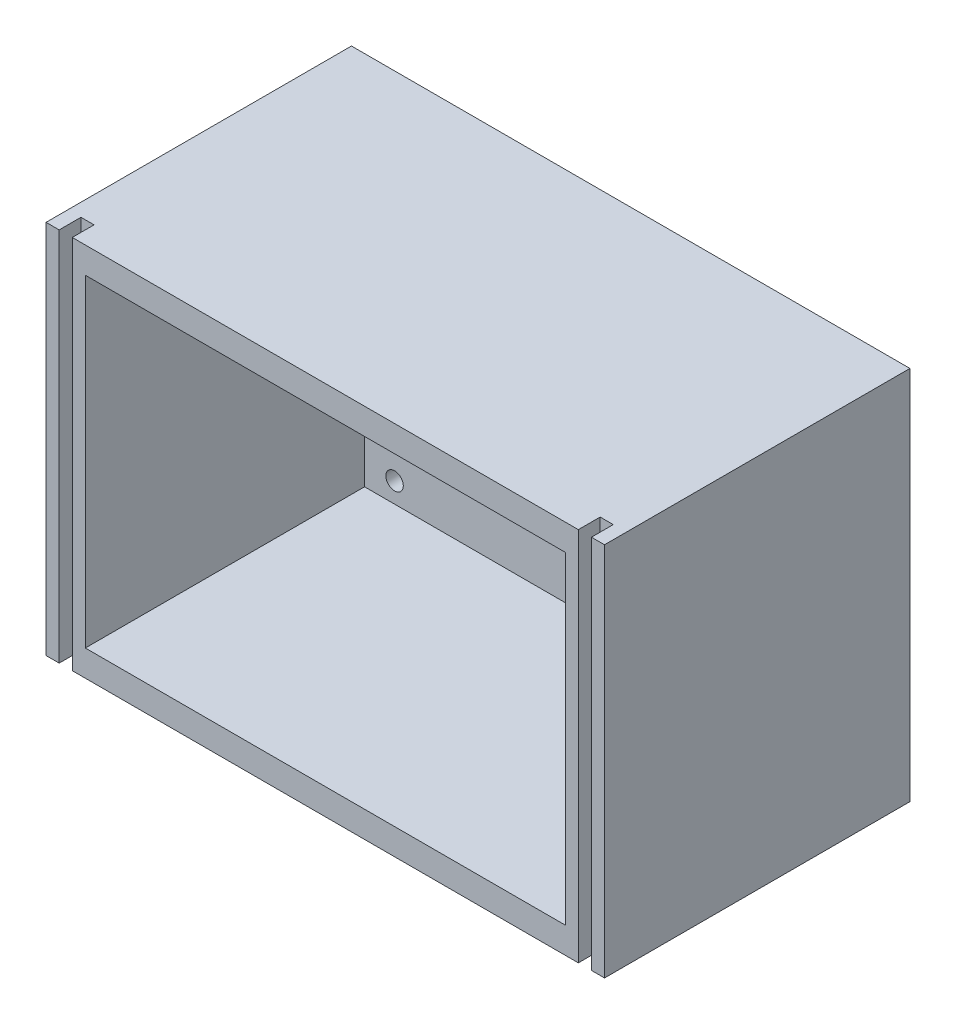
ISO-10303-21;
HEADER;
FILE_DESCRIPTION(('STEP AP214'),'2;1');
FILE_NAME('part.step','',(''),(''),'','','');
FILE_SCHEMA(('AUTOMOTIVE_DESIGN { 1 0 10303 214 1 1 1 1 }'));
ENDSEC;
DATA;
#1=APPLICATION_CONTEXT('core data for automotive mechanical design processes');
#2=APPLICATION_PROTOCOL_DEFINITION('international standard','automotive_design',2000,#1);
#3=PRODUCT_CONTEXT('',#1,'mechanical');
#4=PRODUCT('Part','Part','',(#3));
#5=PRODUCT_RELATED_PRODUCT_CATEGORY('part','',(#4));
#6=PRODUCT_DEFINITION_FORMATION('','',#4);
#7=PRODUCT_DEFINITION_CONTEXT('part definition',#1,'design');
#8=PRODUCT_DEFINITION('design','',#6,#7);
#9=PRODUCT_DEFINITION_SHAPE('','',#8);
#10=(LENGTH_UNIT() NAMED_UNIT(*) SI_UNIT(.MILLI.,.METRE.));
#11=(NAMED_UNIT(*) PLANE_ANGLE_UNIT() SI_UNIT($,.RADIAN.));
#12=(NAMED_UNIT(*) SI_UNIT($,.STERADIAN.) SOLID_ANGLE_UNIT());
#13=UNCERTAINTY_MEASURE_WITH_UNIT(LENGTH_MEASURE(1.E-05),#10,'distance_accuracy_value','');
#14=(GEOMETRIC_REPRESENTATION_CONTEXT(3) GLOBAL_UNCERTAINTY_ASSIGNED_CONTEXT((#13)) GLOBAL_UNIT_ASSIGNED_CONTEXT((#10,
#11,#12)) REPRESENTATION_CONTEXT('',''));
#15=CARTESIAN_POINT('',(0.,0.,0.));
#16=DIRECTION('',(0.,0.,1.));
#17=DIRECTION('',(1.,0.,0.));
#18=AXIS2_PLACEMENT_3D('',#15,#16,#17);
#19=CARTESIAN_POINT('',(60.4226804123711,0.,70.));
#20=DIRECTION('',(-1.,0.,0.));
#21=DIRECTION('',(0.,0.,1.));
#22=AXIS2_PLACEMENT_3D('',#19,#20,#21);
#23=PLANE('',#22);
#24=DIRECTION('',(0.,0.,-1.));
#25=VECTOR('',#24,1.);
#26=CARTESIAN_POINT('',(60.4226804123711,-41.7216494845361,70.));
#27=LINE('',#26,#25);
#28=CARTESIAN_POINT('',(60.4226804123711,-41.7216494845361,70.));
#29=VERTEX_POINT('',#28);
#30=CARTESIAN_POINT('',(60.4226804123711,-41.7216494845361,65.));
#31=VERTEX_POINT('',#30);
#32=EDGE_CURVE('E316',#29,#31,#27,.T.);
#33=ORIENTED_EDGE('',*,*,#32,.T.);
#34=DIRECTION('',(0.,1.,0.));
#35=VECTOR('',#34,1.);
#36=CARTESIAN_POINT('',(60.4226804123711,38.2783505154639,65.));
#37=LINE('',#36,#35);
#38=CARTESIAN_POINT('',(60.4226804123711,44.2783505154639,65.));
#39=VERTEX_POINT('',#38);
#40=EDGE_CURVE('E252',#31,#39,#37,.T.);
#41=ORIENTED_EDGE('',*,*,#40,.T.);
#42=DIRECTION('',(0.,0.,-1.));
#43=VECTOR('',#42,1.);
#44=CARTESIAN_POINT('',(60.4226804123711,44.2783505154639,70.));
#45=LINE('',#44,#43);
#46=CARTESIAN_POINT('',(60.4226804123711,44.2783505154639,70.));
#47=VERTEX_POINT('',#46);
#48=EDGE_CURVE('E11',#47,#39,#45,.T.);
#49=ORIENTED_EDGE('',*,*,#48,.F.);
#50=DIRECTION('',(0.,1.,0.));
#51=VECTOR('',#50,1.);
#52=CARTESIAN_POINT('',(60.4226804123711,0.,70.));
#53=LINE('',#52,#51);
#54=EDGE_CURVE('E305',#29,#47,#53,.T.);
#55=ORIENTED_EDGE('',*,*,#54,.F.);
#56=EDGE_LOOP('',(#33,#41,#49,#55));
#57=FACE_BOUND('',#56,.T.);
#58=ADVANCED_FACE('F35',(#57),#23,.F.);
#59=CARTESIAN_POINT('',(0.,44.2783505154639,70.));
#60=DIRECTION('',(0.,1.,0.));
#61=DIRECTION('',(0.,0.,1.));
#62=AXIS2_PLACEMENT_3D('',#59,#60,#61);
#63=PLANE('',#62);
#64=DIRECTION('',(1.,0.,0.));
#65=VECTOR('',#64,1.);
#66=CARTESIAN_POINT('',(0.,44.2783505154639,0.));
#67=LINE('',#66,#65);
#68=CARTESIAN_POINT('',(-61.5773195876289,44.2783505154639,0.));
#69=VERTEX_POINT('',#68);
#70=CARTESIAN_POINT('',(66.4226804123711,44.2783505154639,0.));
#71=VERTEX_POINT('',#70);
#72=EDGE_CURVE('E295',#69,#71,#67,.T.);
#73=ORIENTED_EDGE('',*,*,#72,.F.);
#74=DIRECTION('',(0.,0.,-1.));
#75=VECTOR('',#74,1.);
#76=CARTESIAN_POINT('',(-61.5773195876289,44.2783505154639,70.));
#77=LINE('',#76,#75);
#78=CARTESIAN_POINT('',(-61.5773195876289,44.2783505154639,70.));
#79=VERTEX_POINT('',#78);
#80=EDGE_CURVE('E278',#79,#69,#77,.T.);
#81=ORIENTED_EDGE('',*,*,#80,.F.);
#82=DIRECTION('',(1.,0.,0.));
#83=VECTOR('',#82,1.);
#84=CARTESIAN_POINT('',(0.,44.2783505154639,70.));
#85=LINE('',#84,#83);
#86=CARTESIAN_POINT('',(-58.5773195876289,44.2783505154639,70.));
#87=VERTEX_POINT('',#86);
#88=EDGE_CURVE('E264',#79,#87,#85,.T.);
#89=ORIENTED_EDGE('',*,*,#88,.T.);
#90=DIRECTION('',(0.,0.,-1.));
#91=VECTOR('',#90,1.);
#92=CARTESIAN_POINT('',(-58.5773195876289,44.2783505154639,70.));
#93=LINE('',#92,#91);
#94=CARTESIAN_POINT('',(-58.5773195876289,44.2783505154639,65.));
#95=VERTEX_POINT('',#94);
#96=EDGE_CURVE('E281',#87,#95,#93,.T.);
#97=ORIENTED_EDGE('',*,*,#96,.T.);
#98=DIRECTION('',(1.,0.,0.));
#99=VECTOR('',#98,1.);
#100=CARTESIAN_POINT('',(-58.5773195876289,44.2783505154639,65.));
#101=LINE('',#100,#99);
#102=CARTESIAN_POINT('',(-55.5773195876289,44.2783505154639,65.));
#103=VERTEX_POINT('',#102);
#104=EDGE_CURVE('E292',#95,#103,#101,.T.);
#105=ORIENTED_EDGE('',*,*,#104,.T.);
#106=DIRECTION('',(0.,0.,-1.));
#107=VECTOR('',#106,1.);
#108=CARTESIAN_POINT('',(-55.5773195876289,44.2783505154639,70.));
#109=LINE('',#108,#107);
#110=CARTESIAN_POINT('',(-55.5773195876289,44.2783505154639,70.));
#111=VERTEX_POINT('',#110);
#112=EDGE_CURVE('E44',#111,#103,#109,.T.);
#113=ORIENTED_EDGE('',*,*,#112,.F.);
#114=DIRECTION('',(1.,0.,0.));
#115=VECTOR('',#114,1.);
#116=CARTESIAN_POINT('',(0.,44.2783505154639,70.));
#117=LINE('',#116,#115);
#118=EDGE_CURVE('E307',#111,#47,#117,.T.);
#119=ORIENTED_EDGE('',*,*,#118,.T.);
#120=ORIENTED_EDGE('',*,*,#48,.T.);
#121=DIRECTION('',(-1.,0.,0.));
#122=VECTOR('',#121,1.);
#123=CARTESIAN_POINT('',(63.4226804123711,44.2783505154639,65.));
#124=LINE('',#123,#122);
#125=CARTESIAN_POINT('',(63.4226804123711,44.2783505154639,65.));
#126=VERTEX_POINT('',#125);
#127=EDGE_CURVE('E255',#126,#39,#124,.T.);
#128=ORIENTED_EDGE('',*,*,#127,.F.);
#129=DIRECTION('',(0.,0.,-1.));
#130=VECTOR('',#129,1.);
#131=CARTESIAN_POINT('',(63.4226804123711,44.2783505154639,70.));
#132=LINE('',#131,#130);
#133=CARTESIAN_POINT('',(63.4226804123711,44.2783505154639,70.));
#134=VERTEX_POINT('',#133);
#135=EDGE_CURVE('E236',#134,#126,#132,.T.);
#136=ORIENTED_EDGE('',*,*,#135,.F.);
#137=DIRECTION('',(1.,0.,0.));
#138=VECTOR('',#137,1.);
#139=CARTESIAN_POINT('',(0.,44.2783505154639,70.));
#140=LINE('',#139,#138);
#141=CARTESIAN_POINT('',(66.4226804123711,44.2783505154639,70.));
#142=VERTEX_POINT('',#141);
#143=EDGE_CURVE('E233',#134,#142,#140,.T.);
#144=ORIENTED_EDGE('',*,*,#143,.T.);
#145=DIRECTION('',(0.,0.,-1.));
#146=VECTOR('',#145,1.);
#147=CARTESIAN_POINT('',(66.4226804123711,44.2783505154639,70.));
#148=LINE('',#147,#146);
#149=EDGE_CURVE('E240',#142,#71,#148,.T.);
#150=ORIENTED_EDGE('',*,*,#149,.T.);
#151=EDGE_LOOP('',(#73,#81,#89,#97,#105,#113,#119,#120,#128,#136,#144,#150));
#152=FACE_BOUND('',#151,.T.);
#153=ADVANCED_FACE('F341',(#152),#63,.T.);
#154=CARTESIAN_POINT('',(-55.5773195876289,0.,70.));
#155=DIRECTION('',(1.,0.,0.));
#156=DIRECTION('',(0.,0.,-1.));
#157=AXIS2_PLACEMENT_3D('',#154,#155,#156);
#158=PLANE('',#157);
#159=ORIENTED_EDGE('',*,*,#112,.T.);
#160=DIRECTION('',(0.,-1.,0.));
#161=VECTOR('',#160,1.);
#162=CARTESIAN_POINT('',(-55.5773195876289,44.2783505154639,65.));
#163=LINE('',#162,#161);
#164=CARTESIAN_POINT('',(-55.5773195876289,-41.7216494845361,65.));
#165=VERTEX_POINT('',#164);
#166=EDGE_CURVE('E284',#103,#165,#163,.T.);
#167=ORIENTED_EDGE('',*,*,#166,.T.);
#168=DIRECTION('',(0.,0.,-1.));
#169=VECTOR('',#168,1.);
#170=CARTESIAN_POINT('',(-55.5773195876289,-41.7216494845361,70.));
#171=LINE('',#170,#169);
#172=CARTESIAN_POINT('',(-55.5773195876289,-41.7216494845361,70.));
#173=VERTEX_POINT('',#172);
#174=EDGE_CURVE('E319',#173,#165,#171,.T.);
#175=ORIENTED_EDGE('',*,*,#174,.F.);
#176=DIRECTION('',(0.,-1.,0.));
#177=VECTOR('',#176,1.);
#178=CARTESIAN_POINT('',(-55.5773195876289,0.,70.));
#179=LINE('',#178,#177);
#180=EDGE_CURVE('E310',#111,#173,#179,.T.);
#181=ORIENTED_EDGE('',*,*,#180,.F.);
#182=EDGE_LOOP('',(#159,#167,#175,#181));
#183=FACE_BOUND('',#182,.T.);
#184=ADVANCED_FACE('F346',(#183),#158,.F.);
#185=CARTESIAN_POINT('',(0.,38.2783505154639,70.));
#186=DIRECTION('',(0.,1.,0.));
#187=DIRECTION('',(0.,0.,1.));
#188=AXIS2_PLACEMENT_3D('',#185,#186,#187);
#189=PLANE('',#188);
#190=DIRECTION('',(0.,0.,-1.));
#191=VECTOR('',#190,1.);
#192=CARTESIAN_POINT('',(-52.5773195876289,38.2783505154639,70.));
#193=LINE('',#192,#191);
#194=CARTESIAN_POINT('',(-52.5773195876289,38.2783505154639,70.));
#195=VERTEX_POINT('',#194);
#196=CARTESIAN_POINT('',(-52.5773195876289,38.2783505154639,6.00000000000001));
#197=VERTEX_POINT('',#196);
#198=EDGE_CURVE('E163',#195,#197,#193,.T.);
#199=ORIENTED_EDGE('',*,*,#198,.T.);
#200=DIRECTION('',(1.,0.,0.));
#201=VECTOR('',#200,1.);
#202=CARTESIAN_POINT('',(0.,38.2783505154639,6.));
#203=LINE('',#202,#201);
#204=CARTESIAN_POINT('',(57.4226804123711,38.2783505154639,6.00000000000001));
#205=VERTEX_POINT('',#204);
#206=EDGE_CURVE('E52',#197,#205,#203,.T.);
#207=ORIENTED_EDGE('',*,*,#206,.T.);
#208=DIRECTION('',(0.,0.,-1.));
#209=VECTOR('',#208,1.);
#210=CARTESIAN_POINT('',(57.4226804123711,38.2783505154639,70.));
#211=LINE('',#210,#209);
#212=CARTESIAN_POINT('',(57.4226804123711,38.2783505154639,70.));
#213=VERTEX_POINT('',#212);
#214=EDGE_CURVE('E39',#213,#205,#211,.T.);
#215=ORIENTED_EDGE('',*,*,#214,.F.);
#216=DIRECTION('',(1.,0.,0.));
#217=VECTOR('',#216,1.);
#218=CARTESIAN_POINT('',(0.,38.2783505154639,70.));
#219=LINE('',#218,#217);
#220=EDGE_CURVE('E296',#195,#213,#219,.T.);
#221=ORIENTED_EDGE('',*,*,#220,.F.);
#222=EDGE_LOOP('',(#199,#207,#215,#221));
#223=FACE_BOUND('',#222,.T.);
#224=ADVANCED_FACE('F37',(#223),#189,.F.);
#225=CARTESIAN_POINT('',(57.4226804123711,0.,70.));
#226=DIRECTION('',(1.,0.,0.));
#227=DIRECTION('',(0.,1.,0.));
#228=AXIS2_PLACEMENT_3D('',#225,#226,#227);
#229=PLANE('',#228);
#230=ORIENTED_EDGE('',*,*,#214,.T.);
#231=DIRECTION('',(0.,-1.,0.));
#232=VECTOR('',#231,1.);
#233=CARTESIAN_POINT('',(57.4226804123711,0.,6.));
#234=LINE('',#233,#232);
#235=CARTESIAN_POINT('',(57.4226804123711,-35.7216494845361,6.00000000000001));
#236=VERTEX_POINT('',#235);
#237=EDGE_CURVE('E59',#205,#236,#234,.T.);
#238=ORIENTED_EDGE('',*,*,#237,.T.);
#239=DIRECTION('',(0.,0.,-1.));
#240=VECTOR('',#239,1.);
#241=CARTESIAN_POINT('',(57.4226804123711,-35.7216494845361,70.));
#242=LINE('',#241,#240);
#243=CARTESIAN_POINT('',(57.4226804123711,-35.7216494845361,70.));
#244=VERTEX_POINT('',#243);
#245=EDGE_CURVE('E162',#244,#236,#242,.T.);
#246=ORIENTED_EDGE('',*,*,#245,.F.);
#247=DIRECTION('',(0.,-1.,0.));
#248=VECTOR('',#247,1.);
#249=CARTESIAN_POINT('',(57.4226804123711,0.,70.));
#250=LINE('',#249,#248);
#251=EDGE_CURVE('E299',#213,#244,#250,.T.);
#252=ORIENTED_EDGE('',*,*,#251,.F.);
#253=EDGE_LOOP('',(#230,#238,#246,#252));
#254=FACE_BOUND('',#253,.T.);
#255=ADVANCED_FACE('F324',(#254),#229,.F.);
#256=CARTESIAN_POINT('',(0.,-35.7216494845361,70.));
#257=DIRECTION('',(0.,1.,0.));
#258=DIRECTION('',(0.,0.,1.));
#259=AXIS2_PLACEMENT_3D('',#256,#257,#258);
#260=PLANE('',#259);
#261=DIRECTION('',(1.,0.,0.));
#262=VECTOR('',#261,1.);
#263=CARTESIAN_POINT('',(0.,-35.7216494845361,6.));
#264=LINE('',#263,#262);
#265=CARTESIAN_POINT('',(-52.5773195876289,-35.7216494845361,6.));
#266=VERTEX_POINT('',#265);
#267=EDGE_CURVE('E166',#266,#236,#264,.T.);
#268=ORIENTED_EDGE('',*,*,#267,.F.);
#269=DIRECTION('',(0.,0.,-1.));
#270=VECTOR('',#269,1.);
#271=CARTESIAN_POINT('',(-52.5773195876289,-35.7216494845361,70.));
#272=LINE('',#271,#270);
#273=CARTESIAN_POINT('',(-52.5773195876289,-35.7216494845361,70.));
#274=VERTEX_POINT('',#273);
#275=EDGE_CURVE('E152',#274,#266,#272,.T.);
#276=ORIENTED_EDGE('',*,*,#275,.F.);
#277=DIRECTION('',(1.,0.,0.));
#278=VECTOR('',#277,1.);
#279=CARTESIAN_POINT('',(0.,-35.7216494845361,70.));
#280=LINE('',#279,#278);
#281=EDGE_CURVE('E302',#274,#244,#280,.T.);
#282=ORIENTED_EDGE('',*,*,#281,.T.);
#283=ORIENTED_EDGE('',*,*,#245,.T.);
#284=EDGE_LOOP('',(#268,#276,#282,#283));
#285=FACE_BOUND('',#284,.T.);
#286=ADVANCED_FACE('F167',(#285),#260,.T.);
#287=CARTESIAN_POINT('',(-52.5773195876289,0.,70.));
#288=DIRECTION('',(1.,0.,0.));
#289=DIRECTION('',(0.,1.,0.));
#290=AXIS2_PLACEMENT_3D('',#287,#288,#289);
#291=PLANE('',#290);
#292=DIRECTION('',(0.,-1.,0.));
#293=VECTOR('',#292,1.);
#294=CARTESIAN_POINT('',(-52.5773195876289,0.,6.));
#295=LINE('',#294,#293);
#296=EDGE_CURVE('E156',#197,#266,#295,.T.);
#297=ORIENTED_EDGE('',*,*,#296,.F.);
#298=ORIENTED_EDGE('',*,*,#198,.F.);
#299=DIRECTION('',(0.,-1.,0.));
#300=VECTOR('',#299,1.);
#301=CARTESIAN_POINT('',(-52.5773195876289,0.,70.));
#302=LINE('',#301,#300);
#303=EDGE_CURVE('E158',#195,#274,#302,.T.);
#304=ORIENTED_EDGE('',*,*,#303,.T.);
#305=ORIENTED_EDGE('',*,*,#275,.T.);
#306=EDGE_LOOP('',(#297,#298,#304,#305));
#307=FACE_BOUND('',#306,.T.);
#308=ADVANCED_FACE('F154',(#307),#291,.T.);
#309=CARTESIAN_POINT('',(0.,-41.7216494845361,70.));
#310=DIRECTION('',(0.,1.,0.));
#311=DIRECTION('',(0.,0.,1.));
#312=AXIS2_PLACEMENT_3D('',#309,#310,#311);
#313=PLANE('',#312);
#314=DIRECTION('',(1.,0.,0.));
#315=VECTOR('',#314,1.);
#316=CARTESIAN_POINT('',(0.,-41.7216494845361,0.));
#317=LINE('',#316,#315);
#318=CARTESIAN_POINT('',(-61.5773195876289,-41.7216494845361,0.));
#319=VERTEX_POINT('',#318);
#320=CARTESIAN_POINT('',(66.4226804123711,-41.7216494845361,0.));
#321=VERTEX_POINT('',#320);
#322=EDGE_CURVE('E300',#319,#321,#317,.T.);
#323=ORIENTED_EDGE('',*,*,#322,.T.);
#324=DIRECTION('',(0.,0.,-1.));
#325=VECTOR('',#324,1.);
#326=CARTESIAN_POINT('',(66.4226804123711,-41.7216494845361,70.));
#327=LINE('',#326,#325);
#328=CARTESIAN_POINT('',(66.4226804123711,-41.7216494845361,70.));
#329=VERTEX_POINT('',#328);
#330=EDGE_CURVE('E243',#329,#321,#327,.T.);
#331=ORIENTED_EDGE('',*,*,#330,.F.);
#332=DIRECTION('',(1.,0.,0.));
#333=VECTOR('',#332,1.);
#334=CARTESIAN_POINT('',(0.,-41.7216494845361,70.));
#335=LINE('',#334,#333);
#336=CARTESIAN_POINT('',(63.4226804123711,-41.7216494845361,70.));
#337=VERTEX_POINT('',#336);
#338=EDGE_CURVE('E228',#337,#329,#335,.T.);
#339=ORIENTED_EDGE('',*,*,#338,.F.);
#340=DIRECTION('',(0.,0.,-1.));
#341=VECTOR('',#340,1.);
#342=CARTESIAN_POINT('',(63.4226804123711,-41.7216494845361,70.));
#343=LINE('',#342,#341);
#344=CARTESIAN_POINT('',(63.4226804123711,-41.7216494845361,65.));
#345=VERTEX_POINT('',#344);
#346=EDGE_CURVE('E246',#337,#345,#343,.T.);
#347=ORIENTED_EDGE('',*,*,#346,.T.);
#348=DIRECTION('',(1.,0.,0.));
#349=VECTOR('',#348,1.);
#350=CARTESIAN_POINT('',(60.4226804123711,-41.7216494845361,65.));
#351=LINE('',#350,#349);
#352=EDGE_CURVE('E249',#31,#345,#351,.T.);
#353=ORIENTED_EDGE('',*,*,#352,.F.);
#354=ORIENTED_EDGE('',*,*,#32,.F.);
#355=DIRECTION('',(1.,0.,0.));
#356=VECTOR('',#355,1.);
#357=CARTESIAN_POINT('',(0.,-41.7216494845361,70.));
#358=LINE('',#357,#356);
#359=EDGE_CURVE('E312',#173,#29,#358,.T.);
#360=ORIENTED_EDGE('',*,*,#359,.F.);
#361=ORIENTED_EDGE('',*,*,#174,.T.);
#362=DIRECTION('',(1.,0.,0.));
#363=VECTOR('',#362,1.);
#364=CARTESIAN_POINT('',(-58.5773195876289,-41.7216494845361,65.));
#365=LINE('',#364,#363);
#366=CARTESIAN_POINT('',(-58.5773195876289,-41.7216494845361,65.));
#367=VERTEX_POINT('',#366);
#368=EDGE_CURVE('E287',#367,#165,#365,.T.);
#369=ORIENTED_EDGE('',*,*,#368,.F.);
#370=DIRECTION('',(0.,0.,-1.));
#371=VECTOR('',#370,1.);
#372=CARTESIAN_POINT('',(-58.5773195876289,-41.7216494845361,70.));
#373=LINE('',#372,#371);
#374=CARTESIAN_POINT('',(-58.5773195876289,-41.7216494845361,70.));
#375=VERTEX_POINT('',#374);
#376=EDGE_CURVE('E271',#375,#367,#373,.T.);
#377=ORIENTED_EDGE('',*,*,#376,.F.);
#378=DIRECTION('',(1.,0.,0.));
#379=VECTOR('',#378,1.);
#380=CARTESIAN_POINT('',(0.,-41.7216494845361,70.));
#381=LINE('',#380,#379);
#382=CARTESIAN_POINT('',(-61.5773195876289,-41.7216494845361,70.));
#383=VERTEX_POINT('',#382);
#384=EDGE_CURVE('E269',#383,#375,#381,.T.);
#385=ORIENTED_EDGE('',*,*,#384,.F.);
#386=DIRECTION('',(0.,0.,-1.));
#387=VECTOR('',#386,1.);
#388=CARTESIAN_POINT('',(-61.5773195876289,-41.7216494845361,70.));
#389=LINE('',#388,#387);
#390=EDGE_CURVE('E275',#383,#319,#389,.T.);
#391=ORIENTED_EDGE('',*,*,#390,.T.);
#392=EDGE_LOOP('',(#323,#331,#339,#347,#353,#354,#360,#361,#369,#377,#385,#391));
#393=FACE_BOUND('',#392,.T.);
#394=ADVANCED_FACE('F331',(#393),#313,.F.);
#395=CARTESIAN_POINT('',(0.,0.,70.));
#396=DIRECTION('',(0.,0.,1.));
#397=DIRECTION('',(1.,0.,0.));
#398=AXIS2_PLACEMENT_3D('',#395,#396,#397);
#399=PLANE('',#398);
#400=ORIENTED_EDGE('',*,*,#220,.T.);
#401=ORIENTED_EDGE('',*,*,#251,.T.);
#402=ORIENTED_EDGE('',*,*,#281,.F.);
#403=ORIENTED_EDGE('',*,*,#303,.F.);
#404=EDGE_LOOP('',(#400,#401,#402,#403));
#405=FACE_BOUND('',#404,.T.);
#406=ORIENTED_EDGE('',*,*,#54,.T.);
#407=ORIENTED_EDGE('',*,*,#118,.F.);
#408=ORIENTED_EDGE('',*,*,#180,.T.);
#409=ORIENTED_EDGE('',*,*,#359,.T.);
#410=EDGE_LOOP('',(#406,#407,#408,#409));
#411=FACE_BOUND('',#410,.T.);
#412=ADVANCED_FACE('F327',(#405,#411),#399,.T.);
#413=CARTESIAN_POINT('',(0.,0.,0.));
#414=DIRECTION('',(0.,0.,1.));
#415=DIRECTION('',(1.,0.,0.));
#416=AXIS2_PLACEMENT_3D('',#413,#414,#415);
#417=PLANE('',#416);
#418=ORIENTED_EDGE('',*,*,#72,.T.);
#419=DIRECTION('',(0.,-1.,0.));
#420=VECTOR('',#419,1.);
#421=CARTESIAN_POINT('',(66.4226804123711,0.,0.));
#422=LINE('',#421,#420);
#423=EDGE_CURVE('E200',#71,#321,#422,.T.);
#424=ORIENTED_EDGE('',*,*,#423,.T.);
#425=ORIENTED_EDGE('',*,*,#322,.F.);
#426=DIRECTION('',(0.,-1.,0.));
#427=VECTOR('',#426,1.);
#428=CARTESIAN_POINT('',(-61.5773195876289,0.,0.));
#429=LINE('',#428,#427);
#430=EDGE_CURVE('E260',#69,#319,#429,.T.);
#431=ORIENTED_EDGE('',*,*,#430,.F.);
#432=EDGE_LOOP('',(#418,#424,#425,#431));
#433=FACE_BOUND('',#432,.T.);
#434=CARTESIAN_POINT('',(50.5465628039717,33.6525986698134,0.));
#435=DIRECTION('',(0.,0.,1.));
#436=DIRECTION('',(1.,0.,0.));
#437=AXIS2_PLACEMENT_3D('',#434,#435,#436);
#438=CIRCLE('',#437,2.);
#439=CARTESIAN_POINT('',(52.5465628039717,33.6525986698134,0.));
#440=VERTEX_POINT('',#439);
#441=EDGE_CURVE('E201',#440,#440,#438,.T.);
#442=ORIENTED_EDGE('',*,*,#441,.T.);
#443=EDGE_LOOP('',(#442));
#444=FACE_BOUND('',#443,.T.);
#445=CARTESIAN_POINT('',(50.5465628039717,-31.0958976388855,0.));
#446=DIRECTION('',(0.,0.,1.));
#447=DIRECTION('',(1.,0.,0.));
#448=AXIS2_PLACEMENT_3D('',#445,#446,#447);
#449=CIRCLE('',#448,2.);
#450=CARTESIAN_POINT('',(52.5465628039717,-31.0958976388855,0.));
#451=VERTEX_POINT('',#450);
#452=EDGE_CURVE('E204',#451,#451,#449,.T.);
#453=ORIENTED_EDGE('',*,*,#452,.T.);
#454=EDGE_LOOP('',(#453));
#455=FACE_BOUND('',#454,.T.);
#456=CARTESIAN_POINT('',(-45.7012019792294,-31.0958976388855,0.));
#457=DIRECTION('',(0.,0.,1.));
#458=DIRECTION('',(1.,0.,0.));
#459=AXIS2_PLACEMENT_3D('',#456,#457,#458);
#460=CIRCLE('',#459,2.);
#461=CARTESIAN_POINT('',(-43.7012019792294,-31.0958976388855,0.));
#462=VERTEX_POINT('',#461);
#463=EDGE_CURVE('E207',#462,#462,#460,.T.);
#464=ORIENTED_EDGE('',*,*,#463,.T.);
#465=EDGE_LOOP('',(#464));
#466=FACE_BOUND('',#465,.T.);
#467=CARTESIAN_POINT('',(-45.7012019792294,-16.0958976388855,0.));
#468=DIRECTION('',(0.,0.,1.));
#469=DIRECTION('',(1.,0.,0.));
#470=AXIS2_PLACEMENT_3D('',#467,#468,#469);
#471=CIRCLE('',#470,2.);
#472=CARTESIAN_POINT('',(-43.7012019792294,-16.0958976388855,0.));
#473=VERTEX_POINT('',#472);
#474=EDGE_CURVE('E210',#473,#473,#471,.T.);
#475=ORIENTED_EDGE('',*,*,#474,.T.);
#476=EDGE_LOOP('',(#475));
#477=FACE_BOUND('',#476,.T.);
#478=CARTESIAN_POINT('',(-45.7012019792294,18.6525986698134,0.));
#479=DIRECTION('',(0.,0.,1.));
#480=DIRECTION('',(1.,0.,0.));
#481=AXIS2_PLACEMENT_3D('',#478,#479,#480);
#482=CIRCLE('',#481,2.);
#483=CARTESIAN_POINT('',(-43.7012019792294,18.6525986698134,0.));
#484=VERTEX_POINT('',#483);
#485=EDGE_CURVE('E213',#484,#484,#482,.T.);
#486=ORIENTED_EDGE('',*,*,#485,.T.);
#487=EDGE_LOOP('',(#486));
#488=FACE_BOUND('',#487,.T.);
#489=CARTESIAN_POINT('',(-45.7012019792294,33.6525986698134,0.));
#490=DIRECTION('',(0.,0.,1.));
#491=DIRECTION('',(1.,0.,0.));
#492=AXIS2_PLACEMENT_3D('',#489,#490,#491);
#493=CIRCLE('',#492,2.);
#494=CARTESIAN_POINT('',(-43.7012019792294,33.6525986698134,0.));
#495=VERTEX_POINT('',#494);
#496=EDGE_CURVE('E216',#495,#495,#493,.T.);
#497=ORIENTED_EDGE('',*,*,#496,.T.);
#498=EDGE_LOOP('',(#497));
#499=FACE_BOUND('',#498,.T.);
#500=CARTESIAN_POINT('',(50.5465628039717,18.6525986698134,0.));
#501=DIRECTION('',(0.,0.,1.));
#502=DIRECTION('',(1.,0.,0.));
#503=AXIS2_PLACEMENT_3D('',#500,#501,#502);
#504=CIRCLE('',#503,2.);
#505=CARTESIAN_POINT('',(52.5465628039717,18.6525986698134,0.));
#506=VERTEX_POINT('',#505);
#507=EDGE_CURVE('E219',#506,#506,#504,.T.);
#508=ORIENTED_EDGE('',*,*,#507,.T.);
#509=EDGE_LOOP('',(#508));
#510=FACE_BOUND('',#509,.T.);
#511=CARTESIAN_POINT('',(50.5465628039717,-16.0958976388856,0.));
#512=DIRECTION('',(0.,0.,1.));
#513=DIRECTION('',(1.,0.,0.));
#514=AXIS2_PLACEMENT_3D('',#511,#512,#513);
#515=CIRCLE('',#514,2.);
#516=CARTESIAN_POINT('',(52.5465628039717,-16.0958976388856,0.));
#517=VERTEX_POINT('',#516);
#518=EDGE_CURVE('E222',#517,#517,#515,.T.);
#519=ORIENTED_EDGE('',*,*,#518,.T.);
#520=EDGE_LOOP('',(#519));
#521=FACE_BOUND('',#520,.T.);
#522=ADVANCED_FACE('F330',(#433,#444,#455,#466,#477,#488,#499,#510,#521),#417,.F.);
#523=CARTESIAN_POINT('',(0.,0.,65.));
#524=DIRECTION('',(0.,0.,1.));
#525=DIRECTION('',(1.,0.,0.));
#526=AXIS2_PLACEMENT_3D('',#523,#524,#525);
#527=PLANE('',#526);
#528=ORIENTED_EDGE('',*,*,#166,.F.);
#529=ORIENTED_EDGE('',*,*,#104,.F.);
#530=DIRECTION('',(0.,-1.,0.));
#531=VECTOR('',#530,1.);
#532=CARTESIAN_POINT('',(-58.5773195876289,-35.7216494845361,65.));
#533=LINE('',#532,#531);
#534=EDGE_CURVE('E289',#95,#367,#533,.T.);
#535=ORIENTED_EDGE('',*,*,#534,.T.);
#536=ORIENTED_EDGE('',*,*,#368,.T.);
#537=EDGE_LOOP('',(#528,#529,#535,#536));
#538=FACE_BOUND('',#537,.T.);
#539=ADVANCED_FACE('F379',(#538),#527,.T.);
#540=CARTESIAN_POINT('',(-58.5773195876289,0.,70.));
#541=DIRECTION('',(1.,0.,0.));
#542=DIRECTION('',(0.,0.,-1.));
#543=AXIS2_PLACEMENT_3D('',#540,#541,#542);
#544=PLANE('',#543);
#545=ORIENTED_EDGE('',*,*,#534,.F.);
#546=ORIENTED_EDGE('',*,*,#96,.F.);
#547=DIRECTION('',(0.,-1.,0.));
#548=VECTOR('',#547,1.);
#549=CARTESIAN_POINT('',(-58.5773195876289,0.,70.));
#550=LINE('',#549,#548);
#551=EDGE_CURVE('E261',#87,#375,#550,.T.);
#552=ORIENTED_EDGE('',*,*,#551,.T.);
#553=ORIENTED_EDGE('',*,*,#376,.T.);
#554=EDGE_LOOP('',(#545,#546,#552,#553));
#555=FACE_BOUND('',#554,.T.);
#556=ADVANCED_FACE('F380',(#555),#544,.T.);
#557=CARTESIAN_POINT('',(-61.5773195876289,0.,70.));
#558=DIRECTION('',(1.,0.,0.));
#559=DIRECTION('',(0.,1.,0.));
#560=AXIS2_PLACEMENT_3D('',#557,#558,#559);
#561=PLANE('',#560);
#562=ORIENTED_EDGE('',*,*,#430,.T.);
#563=ORIENTED_EDGE('',*,*,#390,.F.);
#564=DIRECTION('',(0.,-1.,0.));
#565=VECTOR('',#564,1.);
#566=CARTESIAN_POINT('',(-61.5773195876289,0.,70.));
#567=LINE('',#566,#565);
#568=EDGE_CURVE('E267',#79,#383,#567,.T.);
#569=ORIENTED_EDGE('',*,*,#568,.F.);
#570=ORIENTED_EDGE('',*,*,#80,.T.);
#571=EDGE_LOOP('',(#562,#563,#569,#570));
#572=FACE_BOUND('',#571,.T.);
#573=ADVANCED_FACE('F368',(#572),#561,.F.);
#574=CARTESIAN_POINT('',(0.,0.,70.));
#575=DIRECTION('',(0.,0.,1.));
#576=DIRECTION('',(1.,0.,0.));
#577=AXIS2_PLACEMENT_3D('',#574,#575,#576);
#578=PLANE('',#577);
#579=ORIENTED_EDGE('',*,*,#551,.F.);
#580=ORIENTED_EDGE('',*,*,#88,.F.);
#581=ORIENTED_EDGE('',*,*,#568,.T.);
#582=ORIENTED_EDGE('',*,*,#384,.T.);
#583=EDGE_LOOP('',(#579,#580,#581,#582));
#584=FACE_BOUND('',#583,.T.);
#585=ADVANCED_FACE('F376',(#584),#578,.T.);
#586=CARTESIAN_POINT('',(0.,0.,65.));
#587=DIRECTION('',(0.,0.,1.));
#588=DIRECTION('',(1.,0.,0.));
#589=AXIS2_PLACEMENT_3D('',#586,#587,#588);
#590=PLANE('',#589);
#591=DIRECTION('',(0.,1.,0.));
#592=VECTOR('',#591,1.);
#593=CARTESIAN_POINT('',(63.4226804123711,38.2783505154639,65.));
#594=LINE('',#593,#592);
#595=EDGE_CURVE('E257',#345,#126,#594,.T.);
#596=ORIENTED_EDGE('',*,*,#595,.T.);
#597=ORIENTED_EDGE('',*,*,#127,.T.);
#598=ORIENTED_EDGE('',*,*,#40,.F.);
#599=ORIENTED_EDGE('',*,*,#352,.T.);
#600=EDGE_LOOP('',(#596,#597,#598,#599));
#601=FACE_BOUND('',#600,.T.);
#602=ADVANCED_FACE('F352',(#601),#590,.T.);
#603=CARTESIAN_POINT('',(63.4226804123711,0.,70.));
#604=DIRECTION('',(-1.,0.,0.));
#605=DIRECTION('',(0.,0.,1.));
#606=AXIS2_PLACEMENT_3D('',#603,#604,#605);
#607=PLANE('',#606);
#608=ORIENTED_EDGE('',*,*,#595,.F.);
#609=ORIENTED_EDGE('',*,*,#346,.F.);
#610=DIRECTION('',(0.,1.,0.));
#611=VECTOR('',#610,1.);
#612=CARTESIAN_POINT('',(63.4226804123711,0.,70.));
#613=LINE('',#612,#611);
#614=EDGE_CURVE('E225',#337,#134,#613,.T.);
#615=ORIENTED_EDGE('',*,*,#614,.T.);
#616=ORIENTED_EDGE('',*,*,#135,.T.);
#617=EDGE_LOOP('',(#608,#609,#615,#616));
#618=FACE_BOUND('',#617,.T.);
#619=ADVANCED_FACE('F356',(#618),#607,.T.);
#620=CARTESIAN_POINT('',(66.4226804123711,0.,70.));
#621=DIRECTION('',(1.,0.,0.));
#622=DIRECTION('',(0.,1.,0.));
#623=AXIS2_PLACEMENT_3D('',#620,#621,#622);
#624=PLANE('',#623);
#625=ORIENTED_EDGE('',*,*,#423,.F.);
#626=ORIENTED_EDGE('',*,*,#149,.F.);
#627=DIRECTION('',(0.,-1.,0.));
#628=VECTOR('',#627,1.);
#629=CARTESIAN_POINT('',(66.4226804123711,0.,70.));
#630=LINE('',#629,#628);
#631=EDGE_CURVE('E230',#142,#329,#630,.T.);
#632=ORIENTED_EDGE('',*,*,#631,.T.);
#633=ORIENTED_EDGE('',*,*,#330,.T.);
#634=EDGE_LOOP('',(#625,#626,#632,#633));
#635=FACE_BOUND('',#634,.T.);
#636=ADVANCED_FACE('F363',(#635),#624,.T.);
#637=CARTESIAN_POINT('',(0.,0.,70.));
#638=DIRECTION('',(0.,0.,1.));
#639=DIRECTION('',(1.,0.,0.));
#640=AXIS2_PLACEMENT_3D('',#637,#638,#639);
#641=PLANE('',#640);
#642=ORIENTED_EDGE('',*,*,#614,.F.);
#643=ORIENTED_EDGE('',*,*,#338,.T.);
#644=ORIENTED_EDGE('',*,*,#631,.F.);
#645=ORIENTED_EDGE('',*,*,#143,.F.);
#646=EDGE_LOOP('',(#642,#643,#644,#645));
#647=FACE_BOUND('',#646,.T.);
#648=ADVANCED_FACE('F359',(#647),#641,.T.);
#649=CARTESIAN_POINT('',(50.5465628039717,18.6525986698134,6.));
#650=DIRECTION('',(0.,0.,-1.));
#651=DIRECTION('',(-1.,0.,0.));
#652=AXIS2_PLACEMENT_3D('',#649,#650,#651);
#653=CYLINDRICAL_SURFACE('',#652,2.);
#654=CARTESIAN_POINT('',(50.5465628039717,18.6525986698134,6.));
#655=DIRECTION('',(0.,0.,1.));
#656=DIRECTION('',(1.,0.,0.));
#657=AXIS2_PLACEMENT_3D('',#654,#655,#656);
#658=CIRCLE('',#657,2.);
#659=CARTESIAN_POINT('',(52.5465628039717,18.6525986698134,6.));
#660=VERTEX_POINT('',#659);
#661=EDGE_CURVE('E194',#660,#660,#658,.T.);
#662=ORIENTED_EDGE('',*,*,#661,.T.);
#663=EDGE_LOOP('',(#662));
#664=FACE_BOUND('',#663,.T.);
#665=ORIENTED_EDGE('',*,*,#507,.F.);
#666=EDGE_LOOP('',(#665));
#667=FACE_BOUND('',#666,.T.);
#668=ADVANCED_FACE('F485',(#664,#667),#653,.F.);
#669=CARTESIAN_POINT('',(-45.7012019792294,33.6525986698134,6.));
#670=DIRECTION('',(0.,0.,-1.));
#671=DIRECTION('',(-1.,0.,0.));
#672=AXIS2_PLACEMENT_3D('',#669,#670,#671);
#673=CYLINDRICAL_SURFACE('',#672,2.);
#674=CARTESIAN_POINT('',(-45.7012019792294,33.6525986698134,6.));
#675=DIRECTION('',(0.,0.,1.));
#676=DIRECTION('',(1.,0.,0.));
#677=AXIS2_PLACEMENT_3D('',#674,#675,#676);
#678=CIRCLE('',#677,2.);
#679=CARTESIAN_POINT('',(-43.7012019792294,33.6525986698134,6.));
#680=VERTEX_POINT('',#679);
#681=EDGE_CURVE('E191',#680,#680,#678,.T.);
#682=ORIENTED_EDGE('',*,*,#681,.T.);
#683=EDGE_LOOP('',(#682));
#684=FACE_BOUND('',#683,.T.);
#685=ORIENTED_EDGE('',*,*,#496,.F.);
#686=EDGE_LOOP('',(#685));
#687=FACE_BOUND('',#686,.T.);
#688=ADVANCED_FACE('F600',(#684,#687),#673,.F.);
#689=CARTESIAN_POINT('',(-45.7012019792294,18.6525986698134,6.));
#690=DIRECTION('',(0.,0.,-1.));
#691=DIRECTION('',(-1.,0.,0.));
#692=AXIS2_PLACEMENT_3D('',#689,#690,#691);
#693=CYLINDRICAL_SURFACE('',#692,2.);
#694=CARTESIAN_POINT('',(-45.7012019792294,18.6525986698134,6.));
#695=DIRECTION('',(0.,0.,1.));
#696=DIRECTION('',(1.,0.,0.));
#697=AXIS2_PLACEMENT_3D('',#694,#695,#696);
#698=CIRCLE('',#697,2.);
#699=CARTESIAN_POINT('',(-43.7012019792294,18.6525986698134,6.));
#700=VERTEX_POINT('',#699);
#701=EDGE_CURVE('E188',#700,#700,#698,.T.);
#702=ORIENTED_EDGE('',*,*,#701,.T.);
#703=EDGE_LOOP('',(#702));
#704=FACE_BOUND('',#703,.T.);
#705=ORIENTED_EDGE('',*,*,#485,.F.);
#706=EDGE_LOOP('',(#705));
#707=FACE_BOUND('',#706,.T.);
#708=ADVANCED_FACE('F609',(#704,#707),#693,.F.);
#709=CARTESIAN_POINT('',(-45.7012019792294,-16.0958976388855,6.));
#710=DIRECTION('',(0.,0.,-1.));
#711=DIRECTION('',(-1.,0.,0.));
#712=AXIS2_PLACEMENT_3D('',#709,#710,#711);
#713=CYLINDRICAL_SURFACE('',#712,2.);
#714=CARTESIAN_POINT('',(-45.7012019792294,-16.0958976388855,6.));
#715=DIRECTION('',(0.,0.,1.));
#716=DIRECTION('',(1.,0.,0.));
#717=AXIS2_PLACEMENT_3D('',#714,#715,#716);
#718=CIRCLE('',#717,2.);
#719=CARTESIAN_POINT('',(-43.7012019792294,-16.0958976388855,6.));
#720=VERTEX_POINT('',#719);
#721=EDGE_CURVE('E185',#720,#720,#718,.T.);
#722=ORIENTED_EDGE('',*,*,#721,.T.);
#723=EDGE_LOOP('',(#722));
#724=FACE_BOUND('',#723,.T.);
#725=ORIENTED_EDGE('',*,*,#474,.F.);
#726=EDGE_LOOP('',(#725));
#727=FACE_BOUND('',#726,.T.);
#728=ADVANCED_FACE('F618',(#724,#727),#713,.F.);
#729=CARTESIAN_POINT('',(-45.7012019792294,-31.0958976388855,6.));
#730=DIRECTION('',(0.,0.,-1.));
#731=DIRECTION('',(-1.,0.,0.));
#732=AXIS2_PLACEMENT_3D('',#729,#730,#731);
#733=CYLINDRICAL_SURFACE('',#732,2.);
#734=CARTESIAN_POINT('',(-45.7012019792294,-31.0958976388855,6.));
#735=DIRECTION('',(0.,0.,1.));
#736=DIRECTION('',(1.,0.,0.));
#737=AXIS2_PLACEMENT_3D('',#734,#735,#736);
#738=CIRCLE('',#737,2.);
#739=CARTESIAN_POINT('',(-43.7012019792294,-31.0958976388855,6.));
#740=VERTEX_POINT('',#739);
#741=EDGE_CURVE('E182',#740,#740,#738,.T.);
#742=ORIENTED_EDGE('',*,*,#741,.T.);
#743=EDGE_LOOP('',(#742));
#744=FACE_BOUND('',#743,.T.);
#745=ORIENTED_EDGE('',*,*,#463,.F.);
#746=EDGE_LOOP('',(#745));
#747=FACE_BOUND('',#746,.T.);
#748=ADVANCED_FACE('F627',(#744,#747),#733,.F.);
#749=CARTESIAN_POINT('',(50.5465628039717,-31.0958976388855,6.));
#750=DIRECTION('',(0.,0.,-1.));
#751=DIRECTION('',(-1.,0.,0.));
#752=AXIS2_PLACEMENT_3D('',#749,#750,#751);
#753=CYLINDRICAL_SURFACE('',#752,2.);
#754=CARTESIAN_POINT('',(50.5465628039717,-31.0958976388855,6.));
#755=DIRECTION('',(0.,0.,1.));
#756=DIRECTION('',(1.,0.,0.));
#757=AXIS2_PLACEMENT_3D('',#754,#755,#756);
#758=CIRCLE('',#757,2.);
#759=CARTESIAN_POINT('',(52.5465628039717,-31.0958976388855,6.));
#760=VERTEX_POINT('',#759);
#761=EDGE_CURVE('E179',#760,#760,#758,.T.);
#762=ORIENTED_EDGE('',*,*,#761,.T.);
#763=EDGE_LOOP('',(#762));
#764=FACE_BOUND('',#763,.T.);
#765=ORIENTED_EDGE('',*,*,#452,.F.);
#766=EDGE_LOOP('',(#765));
#767=FACE_BOUND('',#766,.T.);
#768=ADVANCED_FACE('F636',(#764,#767),#753,.F.);
#769=CARTESIAN_POINT('',(50.5465628039717,33.6525986698134,6.));
#770=DIRECTION('',(0.,0.,-1.));
#771=DIRECTION('',(-1.,0.,0.));
#772=AXIS2_PLACEMENT_3D('',#769,#770,#771);
#773=CYLINDRICAL_SURFACE('',#772,2.);
#774=CARTESIAN_POINT('',(50.5465628039717,33.6525986698134,6.));
#775=DIRECTION('',(0.,0.,1.));
#776=DIRECTION('',(1.,0.,0.));
#777=AXIS2_PLACEMENT_3D('',#774,#775,#776);
#778=CIRCLE('',#777,2.);
#779=CARTESIAN_POINT('',(52.5465628039717,33.6525986698134,6.));
#780=VERTEX_POINT('',#779);
#781=EDGE_CURVE('E169',#780,#780,#778,.T.);
#782=ORIENTED_EDGE('',*,*,#781,.T.);
#783=EDGE_LOOP('',(#782));
#784=FACE_BOUND('',#783,.T.);
#785=ORIENTED_EDGE('',*,*,#441,.F.);
#786=EDGE_LOOP('',(#785));
#787=FACE_BOUND('',#786,.T.);
#788=ADVANCED_FACE('F645',(#784,#787),#773,.F.);
#789=CARTESIAN_POINT('',(50.5465628039717,-16.0958976388856,6.));
#790=DIRECTION('',(0.,0.,-1.));
#791=DIRECTION('',(-1.,0.,0.));
#792=AXIS2_PLACEMENT_3D('',#789,#790,#791);
#793=CYLINDRICAL_SURFACE('',#792,2.);
#794=CARTESIAN_POINT('',(50.5465628039717,-16.0958976388856,6.));
#795=DIRECTION('',(0.,0.,1.));
#796=DIRECTION('',(1.,0.,0.));
#797=AXIS2_PLACEMENT_3D('',#794,#795,#796);
#798=CIRCLE('',#797,2.);
#799=CARTESIAN_POINT('',(52.5465628039717,-16.0958976388856,6.));
#800=VERTEX_POINT('',#799);
#801=EDGE_CURVE('E197',#800,#800,#798,.T.);
#802=ORIENTED_EDGE('',*,*,#801,.T.);
#803=EDGE_LOOP('',(#802));
#804=FACE_BOUND('',#803,.T.);
#805=ORIENTED_EDGE('',*,*,#518,.F.);
#806=EDGE_LOOP('',(#805));
#807=FACE_BOUND('',#806,.T.);
#808=ADVANCED_FACE('F654',(#804,#807),#793,.F.);
#809=CARTESIAN_POINT('',(0.,0.,6.));
#810=DIRECTION('',(0.,0.,1.));
#811=DIRECTION('',(1.,0.,0.));
#812=AXIS2_PLACEMENT_3D('',#809,#810,#811);
#813=PLANE('',#812);
#814=ORIENTED_EDGE('',*,*,#237,.F.);
#815=ORIENTED_EDGE('',*,*,#206,.F.);
#816=ORIENTED_EDGE('',*,*,#296,.T.);
#817=ORIENTED_EDGE('',*,*,#267,.T.);
#818=EDGE_LOOP('',(#814,#815,#816,#817));
#819=FACE_BOUND('',#818,.T.);
#820=ORIENTED_EDGE('',*,*,#781,.F.);
#821=EDGE_LOOP('',(#820));
#822=FACE_BOUND('',#821,.T.);
#823=ORIENTED_EDGE('',*,*,#761,.F.);
#824=EDGE_LOOP('',(#823));
#825=FACE_BOUND('',#824,.T.);
#826=ORIENTED_EDGE('',*,*,#741,.F.);
#827=EDGE_LOOP('',(#826));
#828=FACE_BOUND('',#827,.T.);
#829=ORIENTED_EDGE('',*,*,#721,.F.);
#830=EDGE_LOOP('',(#829));
#831=FACE_BOUND('',#830,.T.);
#832=ORIENTED_EDGE('',*,*,#701,.F.);
#833=EDGE_LOOP('',(#832));
#834=FACE_BOUND('',#833,.T.);
#835=ORIENTED_EDGE('',*,*,#681,.F.);
#836=EDGE_LOOP('',(#835));
#837=FACE_BOUND('',#836,.T.);
#838=ORIENTED_EDGE('',*,*,#661,.F.);
#839=EDGE_LOOP('',(#838));
#840=FACE_BOUND('',#839,.T.);
#841=ORIENTED_EDGE('',*,*,#801,.F.);
#842=EDGE_LOOP('',(#841));
#843=FACE_BOUND('',#842,.T.);
#844=ADVANCED_FACE('F171',(#819,#822,#825,#828,#831,#834,#837,#840,#843),#813,.T.);
#845=CLOSED_SHELL('',(#58,#153,#184,#224,#255,#286,#308,#394,#412,#522,#539,#556,#573,#585,#602,
#619,#636,#648,#668,#688,#708,#728,#748,#768,#788,#808,#844));
#846=MANIFOLD_SOLID_BREP('B2',#845);
#847=ADVANCED_BREP_SHAPE_REPRESENTATION('',(#18,#846),#14);
#848=SHAPE_DEFINITION_REPRESENTATION(#9,#847);
ENDSEC;
END-ISO-10303-21;
